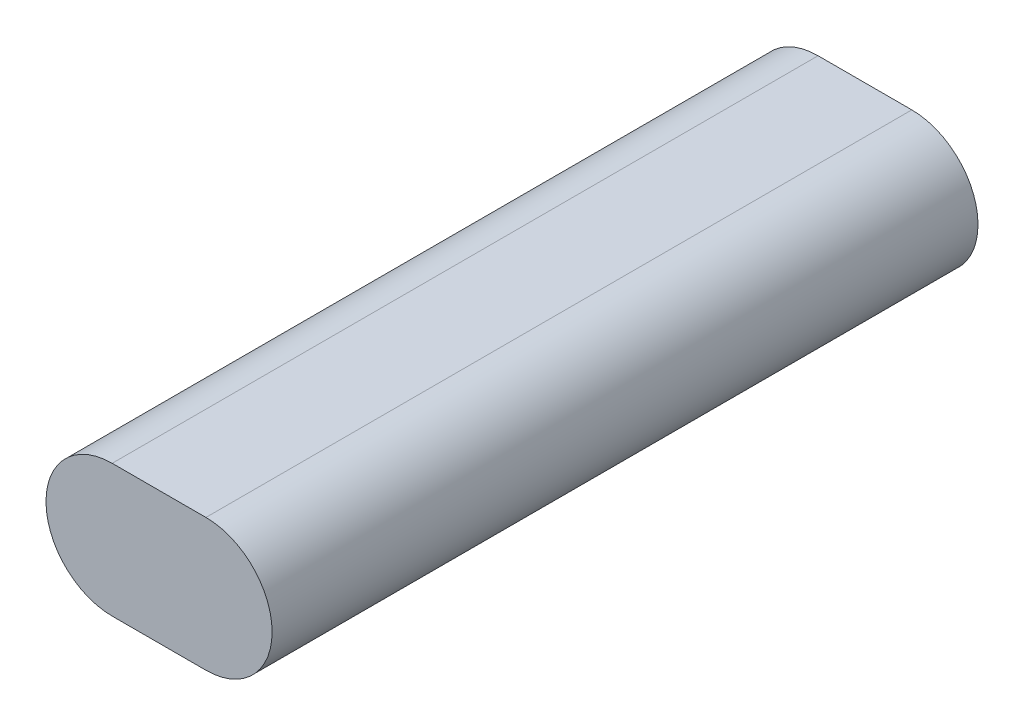
ISO-10303-21;
HEADER;
FILE_DESCRIPTION(('STEP AP214'),'2;1');
FILE_NAME('part.step','',(''),(''),'','','');
FILE_SCHEMA(('AUTOMOTIVE_DESIGN { 1 0 10303 214 1 1 1 1 }'));
ENDSEC;
DATA;
#1=APPLICATION_CONTEXT('core data for automotive mechanical design processes');
#2=APPLICATION_PROTOCOL_DEFINITION('international standard','automotive_design',2000,#1);
#3=PRODUCT_CONTEXT('',#1,'mechanical');
#4=PRODUCT('Part','Part','',(#3));
#5=PRODUCT_RELATED_PRODUCT_CATEGORY('part','',(#4));
#6=PRODUCT_DEFINITION_FORMATION('','',#4);
#7=PRODUCT_DEFINITION_CONTEXT('part definition',#1,'design');
#8=PRODUCT_DEFINITION('design','',#6,#7);
#9=PRODUCT_DEFINITION_SHAPE('','',#8);
#10=(LENGTH_UNIT() NAMED_UNIT(*) SI_UNIT(.MILLI.,.METRE.));
#11=(NAMED_UNIT(*) PLANE_ANGLE_UNIT() SI_UNIT($,.RADIAN.));
#12=(NAMED_UNIT(*) SI_UNIT($,.STERADIAN.) SOLID_ANGLE_UNIT());
#13=UNCERTAINTY_MEASURE_WITH_UNIT(LENGTH_MEASURE(1.E-05),#10,'distance_accuracy_value','');
#14=(GEOMETRIC_REPRESENTATION_CONTEXT(3) GLOBAL_UNCERTAINTY_ASSIGNED_CONTEXT((#13)) GLOBAL_UNIT_ASSIGNED_CONTEXT((#10,
#11,#12)) REPRESENTATION_CONTEXT('',''));
#15=CARTESIAN_POINT('',(0.,0.,0.));
#16=DIRECTION('',(0.,0.,1.));
#17=DIRECTION('',(1.,0.,0.));
#18=AXIS2_PLACEMENT_3D('',#15,#16,#17);
#19=CARTESIAN_POINT('',(-8.5,0.,128.));
#20=DIRECTION('',(0.,0.,-1.));
#21=DIRECTION('',(-1.,0.,0.));
#22=AXIS2_PLACEMENT_3D('',#19,#20,#21);
#23=CYLINDRICAL_SURFACE('',#22,12.);
#24=CARTESIAN_POINT('',(-8.5,0.,0.));
#25=DIRECTION('',(0.,0.,1.));
#26=DIRECTION('',(1.,0.,0.));
#27=AXIS2_PLACEMENT_3D('',#24,#25,#26);
#28=CIRCLE('',#27,12.);
#29=CARTESIAN_POINT('',(-8.5,12.,0.));
#30=VERTEX_POINT('',#29);
#31=CARTESIAN_POINT('',(-8.5,-12.,0.));
#32=VERTEX_POINT('',#31);
#33=EDGE_CURVE('E107',#30,#32,#28,.T.);
#34=ORIENTED_EDGE('',*,*,#33,.T.);
#35=DIRECTION('',(0.,0.,-1.));
#36=VECTOR('',#35,1.);
#37=CARTESIAN_POINT('',(-8.5,-12.,128.));
#38=LINE('',#37,#36);
#39=CARTESIAN_POINT('',(-8.5,-12.,128.));
#40=VERTEX_POINT('',#39);
#41=EDGE_CURVE('E13',#40,#32,#38,.T.);
#42=ORIENTED_EDGE('',*,*,#41,.F.);
#43=CARTESIAN_POINT('',(-8.5,0.,128.));
#44=DIRECTION('',(0.,0.,1.));
#45=DIRECTION('',(1.,0.,0.));
#46=AXIS2_PLACEMENT_3D('',#43,#44,#45);
#47=CIRCLE('',#46,12.);
#48=CARTESIAN_POINT('',(-8.5,12.,128.));
#49=VERTEX_POINT('',#48);
#50=EDGE_CURVE('E95',#49,#40,#47,.T.);
#51=ORIENTED_EDGE('',*,*,#50,.F.);
#52=DIRECTION('',(0.,0.,-1.));
#53=VECTOR('',#52,1.);
#54=CARTESIAN_POINT('',(-8.5,12.,128.));
#55=LINE('',#54,#53);
#56=EDGE_CURVE('E103',#49,#30,#55,.T.);
#57=ORIENTED_EDGE('',*,*,#56,.T.);
#58=EDGE_LOOP('',(#34,#42,#51,#57));
#59=FACE_BOUND('',#58,.T.);
#60=ADVANCED_FACE('F44',(#59),#23,.T.);
#61=CARTESIAN_POINT('',(-8.5,-12.,128.));
#62=DIRECTION('',(0.,1.,0.));
#63=DIRECTION('',(0.,0.,1.));
#64=AXIS2_PLACEMENT_3D('',#61,#62,#63);
#65=PLANE('',#64);
#66=DIRECTION('',(1.,0.,0.));
#67=VECTOR('',#66,1.);
#68=CARTESIAN_POINT('',(-8.5,-12.,0.));
#69=LINE('',#68,#67);
#70=CARTESIAN_POINT('',(8.5,-12.,0.));
#71=VERTEX_POINT('',#70);
#72=EDGE_CURVE('E99',#32,#71,#69,.T.);
#73=ORIENTED_EDGE('',*,*,#72,.T.);
#74=DIRECTION('',(0.,0.,-1.));
#75=VECTOR('',#74,1.);
#76=CARTESIAN_POINT('',(8.5,-12.,128.));
#77=LINE('',#76,#75);
#78=CARTESIAN_POINT('',(8.5,-12.,128.));
#79=VERTEX_POINT('',#78);
#80=EDGE_CURVE('E52',#79,#71,#77,.T.);
#81=ORIENTED_EDGE('',*,*,#80,.F.);
#82=DIRECTION('',(1.,0.,0.));
#83=VECTOR('',#82,1.);
#84=CARTESIAN_POINT('',(-8.5,-12.,128.));
#85=LINE('',#84,#83);
#86=EDGE_CURVE('E90',#40,#79,#85,.T.);
#87=ORIENTED_EDGE('',*,*,#86,.F.);
#88=ORIENTED_EDGE('',*,*,#41,.T.);
#89=EDGE_LOOP('',(#73,#81,#87,#88));
#90=FACE_BOUND('',#89,.T.);
#91=ADVANCED_FACE('F98',(#90),#65,.F.);
#92=CARTESIAN_POINT('',(8.5,0.,128.));
#93=DIRECTION('',(0.,0.,-1.));
#94=DIRECTION('',(-1.,0.,0.));
#95=AXIS2_PLACEMENT_3D('',#92,#93,#94);
#96=CYLINDRICAL_SURFACE('',#95,12.);
#97=CARTESIAN_POINT('',(8.5,0.,0.));
#98=DIRECTION('',(0.,0.,1.));
#99=DIRECTION('',(1.,0.,0.));
#100=AXIS2_PLACEMENT_3D('',#97,#98,#99);
#101=CIRCLE('',#100,12.);
#102=CARTESIAN_POINT('',(8.5,12.,0.));
#103=VERTEX_POINT('',#102);
#104=EDGE_CURVE('E77',#71,#103,#101,.T.);
#105=ORIENTED_EDGE('',*,*,#104,.T.);
#106=DIRECTION('',(0.,0.,-1.));
#107=VECTOR('',#106,1.);
#108=CARTESIAN_POINT('',(8.5,12.,128.));
#109=LINE('',#108,#107);
#110=CARTESIAN_POINT('',(8.5,12.,128.));
#111=VERTEX_POINT('',#110);
#112=EDGE_CURVE('E100',#111,#103,#109,.T.);
#113=ORIENTED_EDGE('',*,*,#112,.F.);
#114=CARTESIAN_POINT('',(8.5,0.,128.));
#115=DIRECTION('',(0.,0.,1.));
#116=DIRECTION('',(1.,0.,0.));
#117=AXIS2_PLACEMENT_3D('',#114,#115,#116);
#118=CIRCLE('',#117,12.);
#119=EDGE_CURVE('E93',#79,#111,#118,.T.);
#120=ORIENTED_EDGE('',*,*,#119,.F.);
#121=ORIENTED_EDGE('',*,*,#80,.T.);
#122=EDGE_LOOP('',(#105,#113,#120,#121));
#123=FACE_BOUND('',#122,.T.);
#124=ADVANCED_FACE('F101',(#123),#96,.T.);
#125=CARTESIAN_POINT('',(-8.5,12.,128.));
#126=DIRECTION('',(0.,-1.,0.));
#127=DIRECTION('',(0.,0.,-1.));
#128=AXIS2_PLACEMENT_3D('',#125,#126,#127);
#129=PLANE('',#128);
#130=DIRECTION('',(-1.,0.,0.));
#131=VECTOR('',#130,1.);
#132=CARTESIAN_POINT('',(-8.5,12.,0.));
#133=LINE('',#132,#131);
#134=EDGE_CURVE('E83',#103,#30,#133,.T.);
#135=ORIENTED_EDGE('',*,*,#134,.T.);
#136=ORIENTED_EDGE('',*,*,#56,.F.);
#137=DIRECTION('',(-1.,0.,0.));
#138=VECTOR('',#137,1.);
#139=CARTESIAN_POINT('',(-8.5,12.,128.));
#140=LINE('',#139,#138);
#141=EDGE_CURVE('E60',#111,#49,#140,.T.);
#142=ORIENTED_EDGE('',*,*,#141,.F.);
#143=ORIENTED_EDGE('',*,*,#112,.T.);
#144=EDGE_LOOP('',(#135,#136,#142,#143));
#145=FACE_BOUND('',#144,.T.);
#146=ADVANCED_FACE('F114',(#145),#129,.F.);
#147=CARTESIAN_POINT('',(-8.5,0.,128.));
#148=DIRECTION('',(0.,0.,1.));
#149=DIRECTION('',(1.,0.,0.));
#150=AXIS2_PLACEMENT_3D('',#147,#148,#149);
#151=PLANE('',#150);
#152=ORIENTED_EDGE('',*,*,#50,.T.);
#153=ORIENTED_EDGE('',*,*,#86,.T.);
#154=ORIENTED_EDGE('',*,*,#119,.T.);
#155=ORIENTED_EDGE('',*,*,#141,.T.);
#156=EDGE_LOOP('',(#152,#153,#154,#155));
#157=FACE_BOUND('',#156,.T.);
#158=ADVANCED_FACE('F91',(#157),#151,.T.);
#159=CARTESIAN_POINT('',(-8.5,0.,0.));
#160=DIRECTION('',(0.,0.,1.));
#161=DIRECTION('',(1.,0.,0.));
#162=AXIS2_PLACEMENT_3D('',#159,#160,#161);
#163=PLANE('',#162);
#164=ORIENTED_EDGE('',*,*,#33,.F.);
#165=ORIENTED_EDGE('',*,*,#134,.F.);
#166=ORIENTED_EDGE('',*,*,#104,.F.);
#167=ORIENTED_EDGE('',*,*,#72,.F.);
#168=EDGE_LOOP('',(#164,#165,#166,#167));
#169=FACE_BOUND('',#168,.T.);
#170=ADVANCED_FACE('F117',(#169),#163,.F.);
#171=CLOSED_SHELL('',(#60,#91,#124,#146,#158,#170));
#172=MANIFOLD_SOLID_BREP('B2',#171);
#173=ADVANCED_BREP_SHAPE_REPRESENTATION('',(#18,#172),#14);
#174=SHAPE_DEFINITION_REPRESENTATION(#9,#173);
ENDSEC;
END-ISO-10303-21;
